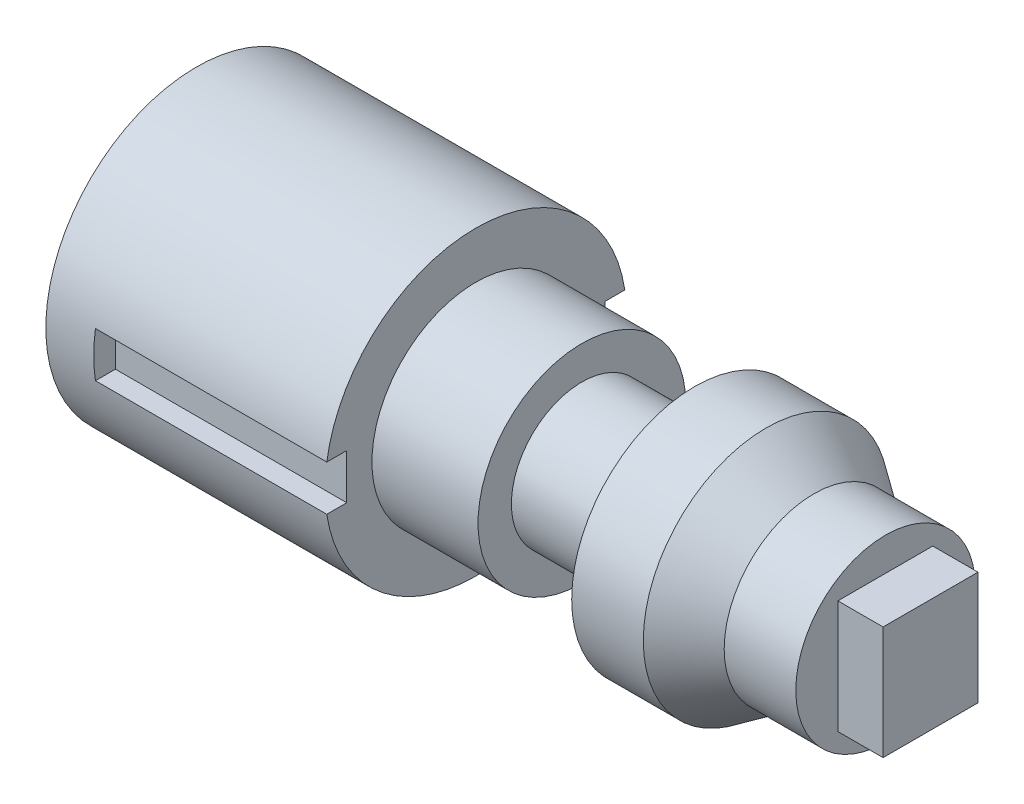
ISO-10303-21;
HEADER;
FILE_DESCRIPTION(('STEP AP214'),'2;1');
FILE_NAME('part.step','',(''),(''),'','','');
FILE_SCHEMA(('AUTOMOTIVE_DESIGN { 1 0 10303 214 1 1 1 1 }'));
ENDSEC;
DATA;
#1=APPLICATION_CONTEXT('core data for automotive mechanical design processes');
#2=APPLICATION_PROTOCOL_DEFINITION('international standard','automotive_design',2000,#1);
#3=PRODUCT_CONTEXT('',#1,'mechanical');
#4=PRODUCT('Part','Part','',(#3));
#5=PRODUCT_RELATED_PRODUCT_CATEGORY('part','',(#4));
#6=PRODUCT_DEFINITION_FORMATION('','',#4);
#7=PRODUCT_DEFINITION_CONTEXT('part definition',#1,'design');
#8=PRODUCT_DEFINITION('design','',#6,#7);
#9=PRODUCT_DEFINITION_SHAPE('','',#8);
#10=(LENGTH_UNIT() NAMED_UNIT(*) SI_UNIT(.MILLI.,.METRE.));
#11=(NAMED_UNIT(*) PLANE_ANGLE_UNIT() SI_UNIT($,.RADIAN.));
#12=(NAMED_UNIT(*) SI_UNIT($,.STERADIAN.) SOLID_ANGLE_UNIT());
#13=UNCERTAINTY_MEASURE_WITH_UNIT(LENGTH_MEASURE(1.E-05),#10,'distance_accuracy_value','');
#14=(GEOMETRIC_REPRESENTATION_CONTEXT(3) GLOBAL_UNCERTAINTY_ASSIGNED_CONTEXT((#13)) GLOBAL_UNIT_ASSIGNED_CONTEXT((#10,
#11,#12)) REPRESENTATION_CONTEXT('',''));
#15=CARTESIAN_POINT('',(0.,0.,0.));
#16=DIRECTION('',(0.,0.,1.));
#17=DIRECTION('',(1.,0.,0.));
#18=AXIS2_PLACEMENT_3D('',#15,#16,#17);
#19=CARTESIAN_POINT('',(45.7085192508289,0.,0.));
#20=DIRECTION('',(1.,0.,0.));
#21=DIRECTION('',(0.,0.,-1.));
#22=AXIS2_PLACEMENT_3D('',#19,#20,#21);
#23=CYLINDRICAL_SURFACE('',#22,10.);
#24=CARTESIAN_POINT('',(0.,0.,0.));
#25=DIRECTION('',(1.,0.,0.));
#26=DIRECTION('',(0.,0.,-1.));
#27=AXIS2_PLACEMENT_3D('',#24,#25,#26);
#28=CIRCLE('',#27,10.);
#29=CARTESIAN_POINT('',(0.,0.,-10.));
#30=VERTEX_POINT('',#29);
#31=EDGE_CURVE('E225',#30,#30,#28,.T.);
#32=ORIENTED_EDGE('',*,*,#31,.T.);
#33=EDGE_LOOP('',(#32));
#34=FACE_BOUND('',#33,.T.);
#35=CARTESIAN_POINT('',(3.17889936513499,0.,0.));
#36=DIRECTION('',(-1.,0.,0.));
#37=DIRECTION('',(0.,0.,1.));
#38=AXIS2_PLACEMENT_3D('',#35,#36,#37);
#39=CIRCLE('',#38,10.);
#40=CARTESIAN_POINT('',(3.17889936513498,-1.5,-9.88685996664259));
#41=VERTEX_POINT('',#40);
#42=CARTESIAN_POINT('',(3.17889936513498,1.5,-9.88685996664259));
#43=VERTEX_POINT('',#42);
#44=EDGE_CURVE('E11',#41,#43,#39,.F.);
#45=ORIENTED_EDGE('',*,*,#44,.F.);
#46=DIRECTION('',(1.,0.,0.));
#47=VECTOR('',#46,1.);
#48=CARTESIAN_POINT('',(45.7085192508289,-1.5,-9.88685996664259));
#49=LINE('',#48,#47);
#50=CARTESIAN_POINT('',(18.5256627897861,-1.5,-9.88685996664259));
#51=VERTEX_POINT('',#50);
#52=EDGE_CURVE('E194',#41,#51,#49,.T.);
#53=ORIENTED_EDGE('',*,*,#52,.T.);
#54=CARTESIAN_POINT('',(18.5256627897861,0.,0.));
#55=DIRECTION('',(1.,0.,0.));
#56=DIRECTION('',(0.,0.,-1.));
#57=AXIS2_PLACEMENT_3D('',#54,#55,#56);
#58=CIRCLE('',#57,10.);
#59=CARTESIAN_POINT('',(18.5256627897861,-1.5,9.88685996664259));
#60=VERTEX_POINT('',#59);
#61=EDGE_CURVE('E221',#60,#51,#58,.T.);
#62=ORIENTED_EDGE('',*,*,#61,.F.);
#63=DIRECTION('',(1.,0.,0.));
#64=VECTOR('',#63,1.);
#65=CARTESIAN_POINT('',(45.7085192508289,-1.5,9.88685996664259));
#66=LINE('',#65,#64);
#67=CARTESIAN_POINT('',(3.17889936513498,-1.5,9.88685996664259));
#68=VERTEX_POINT('',#67);
#69=EDGE_CURVE('E190',#68,#60,#66,.T.);
#70=ORIENTED_EDGE('',*,*,#69,.F.);
#71=CARTESIAN_POINT('',(3.17889936513499,0.,0.));
#72=DIRECTION('',(1.,0.,0.));
#73=DIRECTION('',(0.,0.,-1.));
#74=AXIS2_PLACEMENT_3D('',#71,#72,#73);
#75=CIRCLE('',#74,10.);
#76=CARTESIAN_POINT('',(3.17889936513498,1.5,9.88685996664259));
#77=VERTEX_POINT('',#76);
#78=EDGE_CURVE('E57',#68,#77,#75,.F.);
#79=ORIENTED_EDGE('',*,*,#78,.T.);
#80=DIRECTION('',(1.,0.,0.));
#81=VECTOR('',#80,1.);
#82=CARTESIAN_POINT('',(45.7085192508289,1.5,9.88685996664259));
#83=LINE('',#82,#81);
#84=CARTESIAN_POINT('',(18.5256627897861,1.5,9.88685996664259));
#85=VERTEX_POINT('',#84);
#86=EDGE_CURVE('E179',#77,#85,#83,.T.);
#87=ORIENTED_EDGE('',*,*,#86,.T.);
#88=CARTESIAN_POINT('',(18.5256627897861,1.5,-9.88685996664259));
#89=VERTEX_POINT('',#88);
#90=EDGE_CURVE('E222',#89,#85,#58,.T.);
#91=ORIENTED_EDGE('',*,*,#90,.F.);
#92=DIRECTION('',(1.,0.,0.));
#93=VECTOR('',#92,1.);
#94=CARTESIAN_POINT('',(45.7085192508289,1.5,-9.88685996664259));
#95=LINE('',#94,#93);
#96=EDGE_CURVE('E192',#43,#89,#95,.T.);
#97=ORIENTED_EDGE('',*,*,#96,.F.);
#98=EDGE_LOOP('',(#45,#53,#62,#70,#79,#87,#91,#97));
#99=FACE_BOUND('',#98,.T.);
#100=ADVANCED_FACE('F49',(#34,#99),#23,.T.);
#101=CARTESIAN_POINT('',(18.5256627897861,0.,-10.));
#102=DIRECTION('',(1.,0.,0.));
#103=DIRECTION('',(0.,0.,-1.));
#104=AXIS2_PLACEMENT_3D('',#101,#102,#103);
#105=PLANE('',#104);
#106=CARTESIAN_POINT('',(18.5256627897861,0.,0.));
#107=DIRECTION('',(1.,0.,0.));
#108=DIRECTION('',(0.,0.,-1.));
#109=AXIS2_PLACEMENT_3D('',#106,#107,#108);
#110=CIRCLE('',#109,6.89024048727054);
#111=CARTESIAN_POINT('',(18.5256627897861,0.,-6.89024048727054));
#112=VERTEX_POINT('',#111);
#113=EDGE_CURVE('E218',#112,#112,#110,.T.);
#114=ORIENTED_EDGE('',*,*,#113,.F.);
#115=EDGE_LOOP('',(#114));
#116=FACE_BOUND('',#115,.T.);
#117=ORIENTED_EDGE('',*,*,#61,.T.);
#118=DIRECTION('',(0.,0.,1.));
#119=VECTOR('',#118,1.);
#120=CARTESIAN_POINT('',(18.5256627897861,-1.5,-10.));
#121=LINE('',#120,#119);
#122=CARTESIAN_POINT('',(18.5256627897861,-1.5,-8.56238743965711));
#123=VERTEX_POINT('',#122);
#124=EDGE_CURVE('E240',#51,#123,#121,.T.);
#125=ORIENTED_EDGE('',*,*,#124,.T.);
#126=DIRECTION('',(0.,-1.,0.));
#127=VECTOR('',#126,1.);
#128=CARTESIAN_POINT('',(18.5256627897861,0.,-8.56238743965711));
#129=LINE('',#128,#127);
#130=CARTESIAN_POINT('',(18.5256627897861,1.5,-8.56238743965711));
#131=VERTEX_POINT('',#130);
#132=EDGE_CURVE('E238',#131,#123,#129,.T.);
#133=ORIENTED_EDGE('',*,*,#132,.F.);
#134=DIRECTION('',(0.,0.,1.));
#135=VECTOR('',#134,1.);
#136=CARTESIAN_POINT('',(18.5256627897861,1.5,-10.));
#137=LINE('',#136,#135);
#138=EDGE_CURVE('E236',#89,#131,#137,.T.);
#139=ORIENTED_EDGE('',*,*,#138,.F.);
#140=ORIENTED_EDGE('',*,*,#90,.T.);
#141=DIRECTION('',(0.,0.,-1.));
#142=VECTOR('',#141,1.);
#143=CARTESIAN_POINT('',(18.5256627897861,1.5,-10.));
#144=LINE('',#143,#142);
#145=CARTESIAN_POINT('',(18.5256627897861,1.5,8.56238743965711));
#146=VERTEX_POINT('',#145);
#147=EDGE_CURVE('E228',#85,#146,#144,.T.);
#148=ORIENTED_EDGE('',*,*,#147,.T.);
#149=DIRECTION('',(0.,-1.,0.));
#150=VECTOR('',#149,1.);
#151=CARTESIAN_POINT('',(18.5256627897861,0.,8.56238743965711));
#152=LINE('',#151,#150);
#153=CARTESIAN_POINT('',(18.5256627897861,-1.5,8.56238743965711));
#154=VERTEX_POINT('',#153);
#155=EDGE_CURVE('E231',#146,#154,#152,.T.);
#156=ORIENTED_EDGE('',*,*,#155,.T.);
#157=DIRECTION('',(0.,0.,-1.));
#158=VECTOR('',#157,1.);
#159=CARTESIAN_POINT('',(18.5256627897861,-1.5,-10.));
#160=LINE('',#159,#158);
#161=EDGE_CURVE('E234',#60,#154,#160,.T.);
#162=ORIENTED_EDGE('',*,*,#161,.F.);
#163=EDGE_LOOP('',(#117,#125,#133,#139,#140,#148,#156,#162));
#164=FACE_BOUND('',#163,.T.);
#165=ADVANCED_FACE('F265',(#116,#164),#105,.T.);
#166=CARTESIAN_POINT('',(0.,0.,0.));
#167=DIRECTION('',(-1.,0.,0.));
#168=DIRECTION('',(0.,0.,1.));
#169=AXIS2_PLACEMENT_3D('',#166,#167,#168);
#170=PLANE('',#169);
#171=ORIENTED_EDGE('',*,*,#31,.F.);
#172=EDGE_LOOP('',(#171));
#173=FACE_BOUND('',#172,.T.);
#174=ADVANCED_FACE('F51',(#173),#170,.T.);
#175=CARTESIAN_POINT('',(45.7085192508289,0.,0.));
#176=DIRECTION('',(1.,0.,0.));
#177=DIRECTION('',(0.,0.,-1.));
#178=AXIS2_PLACEMENT_3D('',#175,#176,#177);
#179=CYLINDRICAL_SURFACE('',#178,6.89024048727054);
#180=ORIENTED_EDGE('',*,*,#113,.T.);
#181=EDGE_LOOP('',(#180));
#182=FACE_BOUND('',#181,.T.);
#183=CARTESIAN_POINT('',(25.5632955305092,0.,0.));
#184=DIRECTION('',(1.,0.,0.));
#185=DIRECTION('',(0.,0.,-1.));
#186=AXIS2_PLACEMENT_3D('',#183,#184,#185);
#187=CIRCLE('',#186,6.89024048727054);
#188=CARTESIAN_POINT('',(25.5632955305092,0.,-6.89024048727054));
#189=VERTEX_POINT('',#188);
#190=EDGE_CURVE('E215',#189,#189,#187,.T.);
#191=ORIENTED_EDGE('',*,*,#190,.F.);
#192=EDGE_LOOP('',(#191));
#193=FACE_BOUND('',#192,.T.);
#194=ADVANCED_FACE('F300',(#182,#193),#179,.T.);
#195=CARTESIAN_POINT('',(25.5632955305092,0.,-6.89024048727054));
#196=DIRECTION('',(1.,0.,0.));
#197=DIRECTION('',(0.,0.,-1.));
#198=AXIS2_PLACEMENT_3D('',#195,#196,#197);
#199=PLANE('',#198);
#200=ORIENTED_EDGE('',*,*,#190,.T.);
#201=EDGE_LOOP('',(#200));
#202=FACE_BOUND('',#201,.T.);
#203=CARTESIAN_POINT('',(25.5632955305092,0.,0.));
#204=DIRECTION('',(1.,0.,0.));
#205=DIRECTION('',(0.,0.,-1.));
#206=AXIS2_PLACEMENT_3D('',#203,#204,#205);
#207=CIRCLE('',#206,4.67752868907863);
#208=CARTESIAN_POINT('',(25.5632955305092,0.,-4.67752868907863));
#209=VERTEX_POINT('',#208);
#210=EDGE_CURVE('E212',#209,#209,#207,.T.);
#211=ORIENTED_EDGE('',*,*,#210,.F.);
#212=EDGE_LOOP('',(#211));
#213=FACE_BOUND('',#212,.T.);
#214=ADVANCED_FACE('F303',(#202,#213),#199,.T.);
#215=CARTESIAN_POINT('',(45.7085192508289,0.,0.));
#216=DIRECTION('',(1.,0.,0.));
#217=DIRECTION('',(0.,0.,-1.));
#218=AXIS2_PLACEMENT_3D('',#215,#216,#217);
#219=CYLINDRICAL_SURFACE('',#218,4.67752868907863);
#220=ORIENTED_EDGE('',*,*,#210,.T.);
#221=EDGE_LOOP('',(#220));
#222=FACE_BOUND('',#221,.T.);
#223=CARTESIAN_POINT('',(33.0407803175274,0.,0.));
#224=DIRECTION('',(1.,0.,0.));
#225=DIRECTION('',(0.,0.,-1.));
#226=AXIS2_PLACEMENT_3D('',#223,#224,#225);
#227=CIRCLE('',#226,4.67752868907863);
#228=CARTESIAN_POINT('',(33.0407803175274,0.,-4.67752868907863));
#229=VERTEX_POINT('',#228);
#230=EDGE_CURVE('E209',#229,#229,#227,.T.);
#231=ORIENTED_EDGE('',*,*,#230,.F.);
#232=EDGE_LOOP('',(#231));
#233=FACE_BOUND('',#232,.T.);
#234=ADVANCED_FACE('F307',(#222,#233),#219,.T.);
#235=CARTESIAN_POINT('',(33.0407803175274,0.,-4.67752868907863));
#236=DIRECTION('',(-1.,0.,0.));
#237=DIRECTION('',(0.,0.,1.));
#238=AXIS2_PLACEMENT_3D('',#235,#236,#237);
#239=PLANE('',#238);
#240=ORIENTED_EDGE('',*,*,#230,.T.);
#241=EDGE_LOOP('',(#240));
#242=FACE_BOUND('',#241,.T.);
#243=CARTESIAN_POINT('',(33.0407803175274,0.,0.));
#244=DIRECTION('',(1.,0.,0.));
#245=DIRECTION('',(0.,0.,-1.));
#246=AXIS2_PLACEMENT_3D('',#243,#244,#245);
#247=CIRCLE('',#246,8.1526214055602);
#248=CARTESIAN_POINT('',(33.0407803175274,0.,-8.1526214055602));
#249=VERTEX_POINT('',#248);
#250=EDGE_CURVE('E206',#249,#249,#247,.T.);
#251=ORIENTED_EDGE('',*,*,#250,.F.);
#252=EDGE_LOOP('',(#251));
#253=FACE_BOUND('',#252,.T.);
#254=ADVANCED_FACE('F311',(#242,#253),#239,.T.);
#255=CARTESIAN_POINT('',(45.7085192508289,0.,0.));
#256=DIRECTION('',(1.,0.,0.));
#257=DIRECTION('',(0.,0.,-1.));
#258=AXIS2_PLACEMENT_3D('',#255,#256,#257);
#259=CYLINDRICAL_SURFACE('',#258,8.1526214055602);
#260=ORIENTED_EDGE('',*,*,#250,.T.);
#261=EDGE_LOOP('',(#260));
#262=FACE_BOUND('',#261,.T.);
#263=CARTESIAN_POINT('',(37.7911824175155,0.,0.));
#264=DIRECTION('',(1.,0.,0.));
#265=DIRECTION('',(0.,0.,-1.));
#266=AXIS2_PLACEMENT_3D('',#263,#264,#265);
#267=CIRCLE('',#266,8.1526214055602);
#268=CARTESIAN_POINT('',(37.7911824175155,0.,-8.1526214055602));
#269=VERTEX_POINT('',#268);
#270=EDGE_CURVE('E203',#269,#269,#267,.T.);
#271=ORIENTED_EDGE('',*,*,#270,.F.);
#272=EDGE_LOOP('',(#271));
#273=FACE_BOUND('',#272,.T.);
#274=ADVANCED_FACE('F315',(#262,#273),#259,.T.);
#275=CARTESIAN_POINT('',(40.9581171508409,0.,0.));
#276=DIRECTION('',(-1.,0.,0.));
#277=DIRECTION('',(0.,0.,1.));
#278=AXIS2_PLACEMENT_3D('',#275,#276,#277);
#279=CONICAL_SURFACE('',#278,5.95336117408424,0.606987664046407);
#280=ORIENTED_EDGE('',*,*,#270,.T.);
#281=EDGE_LOOP('',(#280));
#282=FACE_BOUND('',#281,.T.);
#283=CARTESIAN_POINT('',(40.9581171508409,0.,0.));
#284=DIRECTION('',(1.,0.,0.));
#285=DIRECTION('',(0.,0.,-1.));
#286=AXIS2_PLACEMENT_3D('',#283,#284,#285);
#287=CIRCLE('',#286,5.95336117408424);
#288=CARTESIAN_POINT('',(40.9581171508409,0.,-5.95336117408424));
#289=VERTEX_POINT('',#288);
#290=EDGE_CURVE('E200',#289,#289,#287,.T.);
#291=ORIENTED_EDGE('',*,*,#290,.F.);
#292=EDGE_LOOP('',(#291));
#293=FACE_BOUND('',#292,.T.);
#294=ADVANCED_FACE('F319',(#282,#293),#279,.T.);
#295=CARTESIAN_POINT('',(45.7085192508289,0.,0.));
#296=DIRECTION('',(1.,0.,0.));
#297=DIRECTION('',(0.,0.,-1.));
#298=AXIS2_PLACEMENT_3D('',#295,#296,#297);
#299=CYLINDRICAL_SURFACE('',#298,5.95336117408424);
#300=ORIENTED_EDGE('',*,*,#290,.T.);
#301=EDGE_LOOP('',(#300));
#302=FACE_BOUND('',#301,.T.);
#303=CARTESIAN_POINT('',(45.7085192508289,0.,0.));
#304=DIRECTION('',(1.,0.,0.));
#305=DIRECTION('',(0.,0.,-1.));
#306=AXIS2_PLACEMENT_3D('',#303,#304,#305);
#307=CIRCLE('',#306,5.95336117408424);
#308=CARTESIAN_POINT('',(45.7085192508289,0.,-5.95336117408424));
#309=VERTEX_POINT('',#308);
#310=EDGE_CURVE('E197',#309,#309,#307,.T.);
#311=ORIENTED_EDGE('',*,*,#310,.F.);
#312=EDGE_LOOP('',(#311));
#313=FACE_BOUND('',#312,.T.);
#314=ADVANCED_FACE('F323',(#302,#313),#299,.T.);
#315=CARTESIAN_POINT('',(45.7085192508289,0.,-5.95336117408424));
#316=DIRECTION('',(1.,0.,0.));
#317=DIRECTION('',(0.,0.,-1.));
#318=AXIS2_PLACEMENT_3D('',#315,#316,#317);
#319=PLANE('',#318);
#320=DIRECTION('',(0.,-1.,0.));
#321=VECTOR('',#320,1.);
#322=CARTESIAN_POINT('',(45.7085192508289,3.75333974069081,3.16058941680211));
#323=LINE('',#322,#321);
#324=CARTESIAN_POINT('',(45.7085192508289,3.75333974069081,3.16058941680211));
#325=VERTEX_POINT('',#324);
#326=CARTESIAN_POINT('',(45.7085192508289,-3.75574691954495,3.16058941680211));
#327=VERTEX_POINT('',#326);
#328=EDGE_CURVE('E64',#325,#327,#323,.T.);
#329=ORIENTED_EDGE('',*,*,#328,.F.);
#330=DIRECTION('',(0.,0.,1.));
#331=VECTOR('',#330,1.);
#332=CARTESIAN_POINT('',(45.7085192508289,3.75333974069081,3.16058941680211));
#333=LINE('',#332,#331);
#334=CARTESIAN_POINT('',(45.7085192508289,3.75333974069081,-3.13626800680367));
#335=VERTEX_POINT('',#334);
#336=EDGE_CURVE('E68',#335,#325,#333,.T.);
#337=ORIENTED_EDGE('',*,*,#336,.F.);
#338=DIRECTION('',(0.,1.,0.));
#339=VECTOR('',#338,1.);
#340=CARTESIAN_POINT('',(45.7085192508289,3.75333974069081,-3.13626800680367));
#341=LINE('',#340,#339);
#342=CARTESIAN_POINT('',(45.7085192508289,-3.75574691954495,-3.13626800680367));
#343=VERTEX_POINT('',#342);
#344=EDGE_CURVE('E408',#343,#335,#341,.T.);
#345=ORIENTED_EDGE('',*,*,#344,.F.);
#346=DIRECTION('',(0.,0.,-1.));
#347=VECTOR('',#346,1.);
#348=CARTESIAN_POINT('',(45.7085192508289,-3.75574691954495,3.16058941680211));
#349=LINE('',#348,#347);
#350=EDGE_CURVE('E414',#327,#343,#349,.T.);
#351=ORIENTED_EDGE('',*,*,#350,.F.);
#352=EDGE_LOOP('',(#329,#337,#345,#351));
#353=FACE_BOUND('',#352,.T.);
#354=ORIENTED_EDGE('',*,*,#310,.T.);
#355=EDGE_LOOP('',(#354));
#356=FACE_BOUND('',#355,.T.);
#357=ADVANCED_FACE('F326',(#353,#356),#319,.T.);
#358=CARTESIAN_POINT('',(3.17889936513498,-1.5,10.7378474406123));
#359=DIRECTION('',(1.,0.,0.));
#360=DIRECTION('',(0.,0.,-1.));
#361=AXIS2_PLACEMENT_3D('',#358,#359,#360);
#362=PLANE('',#361);
#363=DIRECTION('',(0.,0.,-1.));
#364=VECTOR('',#363,1.);
#365=CARTESIAN_POINT('',(3.17889936513498,-1.5,10.7378474406123));
#366=LINE('',#365,#364);
#367=CARTESIAN_POINT('',(3.17889936513498,-1.5,8.56238743965711));
#368=VERTEX_POINT('',#367);
#369=EDGE_CURVE('E183',#68,#368,#366,.T.);
#370=ORIENTED_EDGE('',*,*,#369,.T.);
#371=DIRECTION('',(0.,1.,0.));
#372=VECTOR('',#371,1.);
#373=CARTESIAN_POINT('',(3.17889936513498,-1.5,8.56238743965711));
#374=LINE('',#373,#372);
#375=CARTESIAN_POINT('',(3.17889936513498,1.5,8.56238743965711));
#376=VERTEX_POINT('',#375);
#377=EDGE_CURVE('E157',#368,#376,#374,.T.);
#378=ORIENTED_EDGE('',*,*,#377,.T.);
#379=DIRECTION('',(0.,0.,-1.));
#380=VECTOR('',#379,1.);
#381=CARTESIAN_POINT('',(3.17889936513498,1.5,10.7378474406123));
#382=LINE('',#381,#380);
#383=EDGE_CURVE('E175',#77,#376,#382,.T.);
#384=ORIENTED_EDGE('',*,*,#383,.F.);
#385=ORIENTED_EDGE('',*,*,#78,.F.);
#386=EDGE_LOOP('',(#370,#378,#384,#385));
#387=FACE_BOUND('',#386,.T.);
#388=ADVANCED_FACE('F251',(#387),#362,.T.);
#389=CARTESIAN_POINT('',(3.17889936513498,-1.5,8.56238743965711));
#390=DIRECTION('',(0.,0.,1.));
#391=DIRECTION('',(1.,0.,0.));
#392=AXIS2_PLACEMENT_3D('',#389,#390,#391);
#393=PLANE('',#392);
#394=DIRECTION('',(1.,0.,0.));
#395=VECTOR('',#394,1.);
#396=CARTESIAN_POINT('',(3.17889936513498,1.5,8.56238743965711));
#397=LINE('',#396,#395);
#398=EDGE_CURVE('E181',#376,#146,#397,.T.);
#399=ORIENTED_EDGE('',*,*,#398,.F.);
#400=ORIENTED_EDGE('',*,*,#377,.F.);
#401=DIRECTION('',(1.,0.,0.));
#402=VECTOR('',#401,1.);
#403=CARTESIAN_POINT('',(3.17889936513498,-1.5,8.56238743965711));
#404=LINE('',#403,#402);
#405=EDGE_CURVE('E160',#368,#154,#404,.T.);
#406=ORIENTED_EDGE('',*,*,#405,.T.);
#407=ORIENTED_EDGE('',*,*,#155,.F.);
#408=EDGE_LOOP('',(#399,#400,#406,#407));
#409=FACE_BOUND('',#408,.T.);
#410=ADVANCED_FACE('F260',(#409),#393,.T.);
#411=CARTESIAN_POINT('',(0.,-1.5,0.));
#412=DIRECTION('',(0.,-1.,0.));
#413=DIRECTION('',(0.,0.,-1.));
#414=AXIS2_PLACEMENT_3D('',#411,#412,#413);
#415=PLANE('',#414);
#416=ORIENTED_EDGE('',*,*,#69,.T.);
#417=ORIENTED_EDGE('',*,*,#161,.T.);
#418=ORIENTED_EDGE('',*,*,#405,.F.);
#419=ORIENTED_EDGE('',*,*,#369,.F.);
#420=EDGE_LOOP('',(#416,#417,#418,#419));
#421=FACE_BOUND('',#420,.T.);
#422=ADVANCED_FACE('F254',(#421),#415,.F.);
#423=CARTESIAN_POINT('',(0.,1.5,0.));
#424=DIRECTION('',(0.,-1.,0.));
#425=DIRECTION('',(0.,0.,-1.));
#426=AXIS2_PLACEMENT_3D('',#423,#424,#425);
#427=PLANE('',#426);
#428=ORIENTED_EDGE('',*,*,#383,.T.);
#429=ORIENTED_EDGE('',*,*,#398,.T.);
#430=ORIENTED_EDGE('',*,*,#147,.F.);
#431=ORIENTED_EDGE('',*,*,#86,.F.);
#432=EDGE_LOOP('',(#428,#429,#430,#431));
#433=FACE_BOUND('',#432,.T.);
#434=ADVANCED_FACE('F262',(#433),#427,.T.);
#435=CARTESIAN_POINT('',(3.17889936513498,-1.5,-10.7378474406123));
#436=DIRECTION('',(-1.,0.,0.));
#437=DIRECTION('',(0.,0.,1.));
#438=AXIS2_PLACEMENT_3D('',#435,#436,#437);
#439=PLANE('',#438);
#440=ORIENTED_EDGE('',*,*,#44,.T.);
#441=DIRECTION('',(0.,0.,1.));
#442=VECTOR('',#441,1.);
#443=CARTESIAN_POINT('',(3.17889936513498,1.5,-10.7378474406123));
#444=LINE('',#443,#442);
#445=CARTESIAN_POINT('',(3.17889936513498,1.5,-8.56238743965711));
#446=VERTEX_POINT('',#445);
#447=EDGE_CURVE('E173',#43,#446,#444,.T.);
#448=ORIENTED_EDGE('',*,*,#447,.T.);
#449=DIRECTION('',(0.,1.,0.));
#450=VECTOR('',#449,1.);
#451=CARTESIAN_POINT('',(3.17889936513498,-1.5,-8.56238743965711));
#452=LINE('',#451,#450);
#453=CARTESIAN_POINT('',(3.17889936513498,-1.5,-8.56238743965711));
#454=VERTEX_POINT('',#453);
#455=EDGE_CURVE('E172',#454,#446,#452,.T.);
#456=ORIENTED_EDGE('',*,*,#455,.F.);
#457=DIRECTION('',(0.,0.,1.));
#458=VECTOR('',#457,1.);
#459=CARTESIAN_POINT('',(3.17889936513498,-1.5,-10.7378474406123));
#460=LINE('',#459,#458);
#461=EDGE_CURVE('E166',#41,#454,#460,.T.);
#462=ORIENTED_EDGE('',*,*,#461,.F.);
#463=EDGE_LOOP('',(#440,#448,#456,#462));
#464=FACE_BOUND('',#463,.T.);
#465=ADVANCED_FACE('F275',(#464),#439,.F.);
#466=CARTESIAN_POINT('',(3.17889936513498,-1.5,-8.56238743965711));
#467=DIRECTION('',(0.,0.,1.));
#468=DIRECTION('',(1.,0.,0.));
#469=AXIS2_PLACEMENT_3D('',#466,#467,#468);
#470=PLANE('',#469);
#471=ORIENTED_EDGE('',*,*,#132,.T.);
#472=DIRECTION('',(1.,0.,0.));
#473=VECTOR('',#472,1.);
#474=CARTESIAN_POINT('',(3.17889936513498,-1.5,-8.56238743965711));
#475=LINE('',#474,#473);
#476=EDGE_CURVE('E168',#454,#123,#475,.T.);
#477=ORIENTED_EDGE('',*,*,#476,.F.);
#478=ORIENTED_EDGE('',*,*,#455,.T.);
#479=DIRECTION('',(1.,0.,0.));
#480=VECTOR('',#479,1.);
#481=CARTESIAN_POINT('',(3.17889936513498,1.5,-8.56238743965711));
#482=LINE('',#481,#480);
#483=EDGE_CURVE('E169',#446,#131,#482,.T.);
#484=ORIENTED_EDGE('',*,*,#483,.T.);
#485=EDGE_LOOP('',(#471,#477,#478,#484));
#486=FACE_BOUND('',#485,.T.);
#487=ADVANCED_FACE('F279',(#486),#470,.F.);
#488=CARTESIAN_POINT('',(0.,-1.5,0.));
#489=DIRECTION('',(0.,1.,0.));
#490=DIRECTION('',(0.,0.,1.));
#491=AXIS2_PLACEMENT_3D('',#488,#489,#490);
#492=PLANE('',#491);
#493=ORIENTED_EDGE('',*,*,#461,.T.);
#494=ORIENTED_EDGE('',*,*,#476,.T.);
#495=ORIENTED_EDGE('',*,*,#124,.F.);
#496=ORIENTED_EDGE('',*,*,#52,.F.);
#497=EDGE_LOOP('',(#493,#494,#495,#496));
#498=FACE_BOUND('',#497,.T.);
#499=ADVANCED_FACE('F281',(#498),#492,.T.);
#500=CARTESIAN_POINT('',(0.,1.5,0.));
#501=DIRECTION('',(0.,1.,0.));
#502=DIRECTION('',(0.,0.,1.));
#503=AXIS2_PLACEMENT_3D('',#500,#501,#502);
#504=PLANE('',#503);
#505=ORIENTED_EDGE('',*,*,#96,.T.);
#506=ORIENTED_EDGE('',*,*,#138,.T.);
#507=ORIENTED_EDGE('',*,*,#483,.F.);
#508=ORIENTED_EDGE('',*,*,#447,.F.);
#509=EDGE_LOOP('',(#505,#506,#507,#508));
#510=FACE_BOUND('',#509,.T.);
#511=ADVANCED_FACE('F271',(#510),#504,.F.);
#512=CARTESIAN_POINT('',(48.7085192508289,3.75333974069081,3.16058941680211));
#513=DIRECTION('',(0.,0.,-1.));
#514=DIRECTION('',(-1.,0.,0.));
#515=AXIS2_PLACEMENT_3D('',#512,#513,#514);
#516=PLANE('',#515);
#517=ORIENTED_EDGE('',*,*,#328,.T.);
#518=DIRECTION('',(-1.,0.,0.));
#519=VECTOR('',#518,1.);
#520=CARTESIAN_POINT('',(48.7085192508289,-3.75574691954495,3.16058941680211));
#521=LINE('',#520,#519);
#522=CARTESIAN_POINT('',(48.7085192508289,-3.75574691954495,3.16058941680211));
#523=VERTEX_POINT('',#522);
#524=EDGE_CURVE('E140',#523,#327,#521,.T.);
#525=ORIENTED_EDGE('',*,*,#524,.F.);
#526=DIRECTION('',(0.,-1.,0.));
#527=VECTOR('',#526,1.);
#528=CARTESIAN_POINT('',(48.7085192508289,3.75333974069081,3.16058941680211));
#529=LINE('',#528,#527);
#530=CARTESIAN_POINT('',(48.7085192508289,3.75333974069081,3.16058941680211));
#531=VERTEX_POINT('',#530);
#532=EDGE_CURVE('E146',#531,#523,#529,.T.);
#533=ORIENTED_EDGE('',*,*,#532,.F.);
#534=DIRECTION('',(-1.,0.,0.));
#535=VECTOR('',#534,1.);
#536=CARTESIAN_POINT('',(48.7085192508289,3.75333974069081,3.16058941680211));
#537=LINE('',#536,#535);
#538=EDGE_CURVE('E406',#531,#325,#537,.T.);
#539=ORIENTED_EDGE('',*,*,#538,.T.);
#540=EDGE_LOOP('',(#517,#525,#533,#539));
#541=FACE_BOUND('',#540,.T.);
#542=ADVANCED_FACE('F156',(#541),#516,.F.);
#543=CARTESIAN_POINT('',(48.7085192508289,-3.75574691954495,3.16058941680211));
#544=DIRECTION('',(0.,1.,0.));
#545=DIRECTION('',(0.,0.,1.));
#546=AXIS2_PLACEMENT_3D('',#543,#544,#545);
#547=PLANE('',#546);
#548=ORIENTED_EDGE('',*,*,#350,.T.);
#549=DIRECTION('',(-1.,0.,0.));
#550=VECTOR('',#549,1.);
#551=CARTESIAN_POINT('',(48.7085192508289,-3.75574691954495,-3.13626800680367));
#552=LINE('',#551,#550);
#553=CARTESIAN_POINT('',(48.7085192508289,-3.75574691954495,-3.13626800680367));
#554=VERTEX_POINT('',#553);
#555=EDGE_CURVE('E142',#554,#343,#552,.T.);
#556=ORIENTED_EDGE('',*,*,#555,.F.);
#557=DIRECTION('',(0.,0.,-1.));
#558=VECTOR('',#557,1.);
#559=CARTESIAN_POINT('',(48.7085192508289,-3.75574691954495,3.16058941680211));
#560=LINE('',#559,#558);
#561=EDGE_CURVE('E135',#523,#554,#560,.T.);
#562=ORIENTED_EDGE('',*,*,#561,.F.);
#563=ORIENTED_EDGE('',*,*,#524,.T.);
#564=EDGE_LOOP('',(#548,#556,#562,#563));
#565=FACE_BOUND('',#564,.T.);
#566=ADVANCED_FACE('F138',(#565),#547,.F.);
#567=CARTESIAN_POINT('',(48.7085192508289,3.75333974069081,-3.13626800680367));
#568=DIRECTION('',(0.,0.,1.));
#569=DIRECTION('',(1.,0.,0.));
#570=AXIS2_PLACEMENT_3D('',#567,#568,#569);
#571=PLANE('',#570);
#572=ORIENTED_EDGE('',*,*,#344,.T.);
#573=DIRECTION('',(-1.,0.,0.));
#574=VECTOR('',#573,1.);
#575=CARTESIAN_POINT('',(48.7085192508289,3.75333974069081,-3.13626800680367));
#576=LINE('',#575,#574);
#577=CARTESIAN_POINT('',(48.7085192508289,3.75333974069081,-3.13626800680367));
#578=VERTEX_POINT('',#577);
#579=EDGE_CURVE('E162',#578,#335,#576,.T.);
#580=ORIENTED_EDGE('',*,*,#579,.F.);
#581=DIRECTION('',(0.,1.,0.));
#582=VECTOR('',#581,1.);
#583=CARTESIAN_POINT('',(48.7085192508289,3.75333974069081,-3.13626800680367));
#584=LINE('',#583,#582);
#585=EDGE_CURVE('E145',#554,#578,#584,.T.);
#586=ORIENTED_EDGE('',*,*,#585,.F.);
#587=ORIENTED_EDGE('',*,*,#555,.T.);
#588=EDGE_LOOP('',(#572,#580,#586,#587));
#589=FACE_BOUND('',#588,.T.);
#590=ADVANCED_FACE('F375',(#589),#571,.F.);
#591=CARTESIAN_POINT('',(48.7085192508289,3.75333974069081,3.16058941680211));
#592=DIRECTION('',(0.,-1.,0.));
#593=DIRECTION('',(0.,0.,-1.));
#594=AXIS2_PLACEMENT_3D('',#591,#592,#593);
#595=PLANE('',#594);
#596=ORIENTED_EDGE('',*,*,#336,.T.);
#597=ORIENTED_EDGE('',*,*,#538,.F.);
#598=DIRECTION('',(0.,0.,1.));
#599=VECTOR('',#598,1.);
#600=CARTESIAN_POINT('',(48.7085192508289,3.75333974069081,3.16058941680211));
#601=LINE('',#600,#599);
#602=EDGE_CURVE('E151',#578,#531,#601,.T.);
#603=ORIENTED_EDGE('',*,*,#602,.F.);
#604=ORIENTED_EDGE('',*,*,#579,.T.);
#605=EDGE_LOOP('',(#596,#597,#603,#604));
#606=FACE_BOUND('',#605,.T.);
#607=ADVANCED_FACE('F384',(#606),#595,.F.);
#608=CARTESIAN_POINT('',(48.7085192508289,0.,0.));
#609=DIRECTION('',(1.,0.,0.));
#610=DIRECTION('',(0.,0.,-1.));
#611=AXIS2_PLACEMENT_3D('',#608,#609,#610);
#612=PLANE('',#611);
#613=ORIENTED_EDGE('',*,*,#532,.T.);
#614=ORIENTED_EDGE('',*,*,#561,.T.);
#615=ORIENTED_EDGE('',*,*,#585,.T.);
#616=ORIENTED_EDGE('',*,*,#602,.T.);
#617=EDGE_LOOP('',(#613,#614,#615,#616));
#618=FACE_BOUND('',#617,.T.);
#619=ADVANCED_FACE('F149',(#618),#612,.T.);
#620=CLOSED_SHELL('',(#100,#165,#174,#194,#214,#234,#254,#274,#294,#314,#357,#388,#410,#422,
#434,#465,#487,#499,#511,#542,#566,#590,#607,#619));
#621=MANIFOLD_SOLID_BREP('B2',#620);
#622=ADVANCED_BREP_SHAPE_REPRESENTATION('',(#18,#621),#14);
#623=SHAPE_DEFINITION_REPRESENTATION(#9,#622);
ENDSEC;
END-ISO-10303-21;
